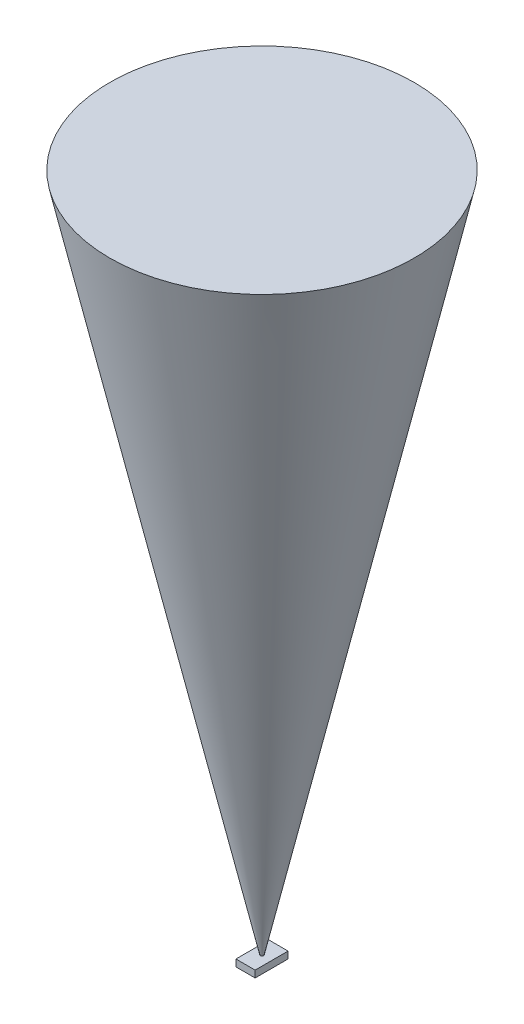
ISO-10303-21;
HEADER;
FILE_DESCRIPTION(('STEP AP214'),'2;1');
FILE_NAME('part.step','',(''),(''),'','','');
FILE_SCHEMA(('AUTOMOTIVE_DESIGN { 1 0 10303 214 1 1 1 1 }'));
ENDSEC;
DATA;
#1=APPLICATION_CONTEXT('core data for automotive mechanical design processes');
#2=APPLICATION_PROTOCOL_DEFINITION('international standard','automotive_design',2000,#1);
#3=PRODUCT_CONTEXT('',#1,'mechanical');
#4=PRODUCT('Part','Part','',(#3));
#5=PRODUCT_RELATED_PRODUCT_CATEGORY('part','',(#4));
#6=PRODUCT_DEFINITION_FORMATION('','',#4);
#7=PRODUCT_DEFINITION_CONTEXT('part definition',#1,'design');
#8=PRODUCT_DEFINITION('design','',#6,#7);
#9=PRODUCT_DEFINITION_SHAPE('','',#8);
#10=(LENGTH_UNIT() NAMED_UNIT(*) SI_UNIT(.MILLI.,.METRE.));
#11=(NAMED_UNIT(*) PLANE_ANGLE_UNIT() SI_UNIT($,.RADIAN.));
#12=(NAMED_UNIT(*) SI_UNIT($,.STERADIAN.) SOLID_ANGLE_UNIT());
#13=UNCERTAINTY_MEASURE_WITH_UNIT(LENGTH_MEASURE(1.E-05),#10,'distance_accuracy_value','');
#14=(GEOMETRIC_REPRESENTATION_CONTEXT(3) GLOBAL_UNCERTAINTY_ASSIGNED_CONTEXT((#13)) GLOBAL_UNIT_ASSIGNED_CONTEXT((#10,
#11,#12)) REPRESENTATION_CONTEXT('',''));
#15=CARTESIAN_POINT('',(0.,0.,0.));
#16=DIRECTION('',(0.,0.,1.));
#17=DIRECTION('',(1.,0.,0.));
#18=AXIS2_PLACEMENT_3D('',#15,#16,#17);
#19=CARTESIAN_POINT('',(-1.4,1.,-2.4));
#20=DIRECTION('',(1.,0.,0.));
#21=DIRECTION('',(0.,0.,-1.));
#22=AXIS2_PLACEMENT_3D('',#19,#20,#21);
#23=PLANE('',#22);
#24=DIRECTION('',(0.,0.,1.));
#25=VECTOR('',#24,1.);
#26=CARTESIAN_POINT('',(-1.4,0.,-2.4));
#27=LINE('',#26,#25);
#28=CARTESIAN_POINT('',(-1.4,0.,-2.4));
#29=VERTEX_POINT('',#28);
#30=CARTESIAN_POINT('',(-1.4,0.,2.4));
#31=VERTEX_POINT('',#30);
#32=EDGE_CURVE('E104',#29,#31,#27,.T.);
#33=ORIENTED_EDGE('',*,*,#32,.T.);
#34=DIRECTION('',(0.,-1.,0.));
#35=VECTOR('',#34,1.);
#36=CARTESIAN_POINT('',(-1.4,1.,2.4));
#37=LINE('',#36,#35);
#38=CARTESIAN_POINT('',(-1.4,1.,2.4));
#39=VERTEX_POINT('',#38);
#40=EDGE_CURVE('E42',#39,#31,#37,.T.);
#41=ORIENTED_EDGE('',*,*,#40,.F.);
#42=DIRECTION('',(0.,0.,1.));
#43=VECTOR('',#42,1.);
#44=CARTESIAN_POINT('',(-1.4,1.,-2.4));
#45=LINE('',#44,#43);
#46=CARTESIAN_POINT('',(-1.4,1.,-2.4));
#47=VERTEX_POINT('',#46);
#48=EDGE_CURVE('E87',#47,#39,#45,.T.);
#49=ORIENTED_EDGE('',*,*,#48,.F.);
#50=DIRECTION('',(0.,-1.,0.));
#51=VECTOR('',#50,1.);
#52=CARTESIAN_POINT('',(-1.4,1.,-2.4));
#53=LINE('',#52,#51);
#54=EDGE_CURVE('E100',#47,#29,#53,.T.);
#55=ORIENTED_EDGE('',*,*,#54,.T.);
#56=EDGE_LOOP('',(#33,#41,#49,#55));
#57=FACE_BOUND('',#56,.T.);
#58=ADVANCED_FACE('F35',(#57),#23,.F.);
#59=CARTESIAN_POINT('',(-1.4,1.,2.4));
#60=DIRECTION('',(0.,0.,-1.));
#61=DIRECTION('',(-1.,0.,0.));
#62=AXIS2_PLACEMENT_3D('',#59,#60,#61);
#63=PLANE('',#62);
#64=DIRECTION('',(1.,0.,0.));
#65=VECTOR('',#64,1.);
#66=CARTESIAN_POINT('',(-1.4,0.,2.4));
#67=LINE('',#66,#65);
#68=CARTESIAN_POINT('',(1.4,0.,2.4));
#69=VERTEX_POINT('',#68);
#70=EDGE_CURVE('E93',#31,#69,#67,.T.);
#71=ORIENTED_EDGE('',*,*,#70,.T.);
#72=DIRECTION('',(0.,-1.,0.));
#73=VECTOR('',#72,1.);
#74=CARTESIAN_POINT('',(1.4,1.,2.4));
#75=LINE('',#74,#73);
#76=CARTESIAN_POINT('',(1.4,1.,2.4));
#77=VERTEX_POINT('',#76);
#78=EDGE_CURVE('E91',#77,#69,#75,.T.);
#79=ORIENTED_EDGE('',*,*,#78,.F.);
#80=DIRECTION('',(1.,0.,0.));
#81=VECTOR('',#80,1.);
#82=CARTESIAN_POINT('',(-1.4,1.,2.4));
#83=LINE('',#82,#81);
#84=EDGE_CURVE('E81',#39,#77,#83,.T.);
#85=ORIENTED_EDGE('',*,*,#84,.F.);
#86=ORIENTED_EDGE('',*,*,#40,.T.);
#87=EDGE_LOOP('',(#71,#79,#85,#86));
#88=FACE_BOUND('',#87,.T.);
#89=ADVANCED_FACE('F92',(#88),#63,.F.);
#90=CARTESIAN_POINT('',(1.4,1.,-2.4));
#91=DIRECTION('',(-1.,0.,0.));
#92=DIRECTION('',(0.,0.,1.));
#93=AXIS2_PLACEMENT_3D('',#90,#91,#92);
#94=PLANE('',#93);
#95=DIRECTION('',(0.,0.,-1.));
#96=VECTOR('',#95,1.);
#97=CARTESIAN_POINT('',(1.4,0.,-2.4));
#98=LINE('',#97,#96);
#99=CARTESIAN_POINT('',(1.4,0.,-2.4));
#100=VERTEX_POINT('',#99);
#101=EDGE_CURVE('E109',#69,#100,#98,.T.);
#102=ORIENTED_EDGE('',*,*,#101,.T.);
#103=DIRECTION('',(0.,-1.,0.));
#104=VECTOR('',#103,1.);
#105=CARTESIAN_POINT('',(1.4,1.,-2.4));
#106=LINE('',#105,#104);
#107=CARTESIAN_POINT('',(1.4,1.,-2.4));
#108=VERTEX_POINT('',#107);
#109=EDGE_CURVE('E96',#108,#100,#106,.T.);
#110=ORIENTED_EDGE('',*,*,#109,.F.);
#111=DIRECTION('',(0.,0.,-1.));
#112=VECTOR('',#111,1.);
#113=CARTESIAN_POINT('',(1.4,1.,-2.4));
#114=LINE('',#113,#112);
#115=EDGE_CURVE('E84',#77,#108,#114,.T.);
#116=ORIENTED_EDGE('',*,*,#115,.F.);
#117=ORIENTED_EDGE('',*,*,#78,.T.);
#118=EDGE_LOOP('',(#102,#110,#116,#117));
#119=FACE_BOUND('',#118,.T.);
#120=ADVANCED_FACE('F98',(#119),#94,.F.);
#121=CARTESIAN_POINT('',(-1.4,1.,-2.4));
#122=DIRECTION('',(0.,0.,1.));
#123=DIRECTION('',(1.,0.,0.));
#124=AXIS2_PLACEMENT_3D('',#121,#122,#123);
#125=PLANE('',#124);
#126=DIRECTION('',(-1.,0.,0.));
#127=VECTOR('',#126,1.);
#128=CARTESIAN_POINT('',(-1.4,0.,-2.4));
#129=LINE('',#128,#127);
#130=EDGE_CURVE('E73',#100,#29,#129,.T.);
#131=ORIENTED_EDGE('',*,*,#130,.T.);
#132=ORIENTED_EDGE('',*,*,#54,.F.);
#133=DIRECTION('',(-1.,0.,0.));
#134=VECTOR('',#133,1.);
#135=CARTESIAN_POINT('',(-1.4,1.,-2.4));
#136=LINE('',#135,#134);
#137=EDGE_CURVE('E53',#108,#47,#136,.T.);
#138=ORIENTED_EDGE('',*,*,#137,.F.);
#139=ORIENTED_EDGE('',*,*,#109,.T.);
#140=EDGE_LOOP('',(#131,#132,#138,#139));
#141=FACE_BOUND('',#140,.T.);
#142=ADVANCED_FACE('F117',(#141),#125,.F.);
#143=CARTESIAN_POINT('',(0.,1.,0.));
#144=DIRECTION('',(0.,1.,0.));
#145=DIRECTION('',(0.,0.,1.));
#146=AXIS2_PLACEMENT_3D('',#143,#144,#145);
#147=PLANE('',#146);
#148=CARTESIAN_POINT('',(0.,1.,0.));
#149=DIRECTION('',(0.,1.,0.));
#150=DIRECTION('',(0.,0.,1.));
#151=AXIS2_PLACEMENT_3D('',#148,#149,#150);
#152=CIRCLE('',#151,0.221694662642933);
#153=CARTESIAN_POINT('',(0.,1.,0.221694662642933));
#154=VERTEX_POINT('',#153);
#155=EDGE_CURVE('E11',#154,#154,#152,.T.);
#156=ORIENTED_EDGE('',*,*,#155,.F.);
#157=EDGE_LOOP('',(#156));
#158=FACE_BOUND('',#157,.T.);
#159=ORIENTED_EDGE('',*,*,#48,.T.);
#160=ORIENTED_EDGE('',*,*,#84,.T.);
#161=ORIENTED_EDGE('',*,*,#115,.T.);
#162=ORIENTED_EDGE('',*,*,#137,.T.);
#163=EDGE_LOOP('',(#159,#160,#161,#162));
#164=FACE_BOUND('',#163,.T.);
#165=ADVANCED_FACE('F82',(#158,#164),#147,.T.);
#166=CARTESIAN_POINT('',(0.,0.,0.));
#167=DIRECTION('',(0.,1.,0.));
#168=DIRECTION('',(0.,0.,1.));
#169=AXIS2_PLACEMENT_3D('',#166,#167,#168);
#170=PLANE('',#169);
#171=CARTESIAN_POINT('',(0.,0.,0.));
#172=VERTEX_POINT('',#171);
#173=VERTEX_LOOP('',#172);
#174=FACE_BOUND('',#173,.T.);
#175=ORIENTED_EDGE('',*,*,#32,.F.);
#176=ORIENTED_EDGE('',*,*,#130,.F.);
#177=ORIENTED_EDGE('',*,*,#101,.F.);
#178=ORIENTED_EDGE('',*,*,#70,.F.);
#179=EDGE_LOOP('',(#175,#176,#177,#178));
#180=FACE_BOUND('',#179,.T.);
#181=ADVANCED_FACE('F116',(#174,#180),#170,.F.);
#182=CARTESIAN_POINT('',(0.,0.,0.));
#183=DIRECTION('',(0.,1.,0.));
#184=DIRECTION('',(0.,0.,1.));
#185=AXIS2_PLACEMENT_3D('',#182,#183,#184);
#186=CONICAL_SURFACE('',#185,0.,0.218166156499285);
#187=ORIENTED_EDGE('',*,*,#155,.T.);
#188=EDGE_LOOP('',(#187));
#189=FACE_BOUND('',#188,.T.);
#190=CARTESIAN_POINT('',(0.,100.,0.));
#191=DIRECTION('',(0.,-1.,0.));
#192=DIRECTION('',(0.,0.,-1.));
#193=AXIS2_PLACEMENT_3D('',#190,#191,#192);
#194=CIRCLE('',#193,22.1694662642933);
#195=CARTESIAN_POINT('',(0.,100.,-22.1694662642933));
#196=VERTEX_POINT('',#195);
#197=EDGE_CURVE('E107',#196,#196,#194,.T.);
#198=ORIENTED_EDGE('',*,*,#197,.T.);
#199=EDGE_LOOP('',(#198));
#200=FACE_BOUND('',#199,.T.);
#201=ADVANCED_FACE('F122',(#189,#200),#186,.T.);
#202=CARTESIAN_POINT('',(0.,100.,0.));
#203=DIRECTION('',(0.,1.,0.));
#204=DIRECTION('',(0.,0.,1.));
#205=AXIS2_PLACEMENT_3D('',#202,#203,#204);
#206=PLANE('',#205);
#207=ORIENTED_EDGE('',*,*,#197,.F.);
#208=EDGE_LOOP('',(#207));
#209=FACE_BOUND('',#208,.T.);
#210=ADVANCED_FACE('F124',(#209),#206,.T.);
#211=CLOSED_SHELL('',(#58,#89,#120,#142,#165,#181,#201,#210));
#212=MANIFOLD_SOLID_BREP('B2',#211);
#213=ADVANCED_BREP_SHAPE_REPRESENTATION('',(#18,#212),#14);
#214=SHAPE_DEFINITION_REPRESENTATION(#9,#213);
ENDSEC;
END-ISO-10303-21;
